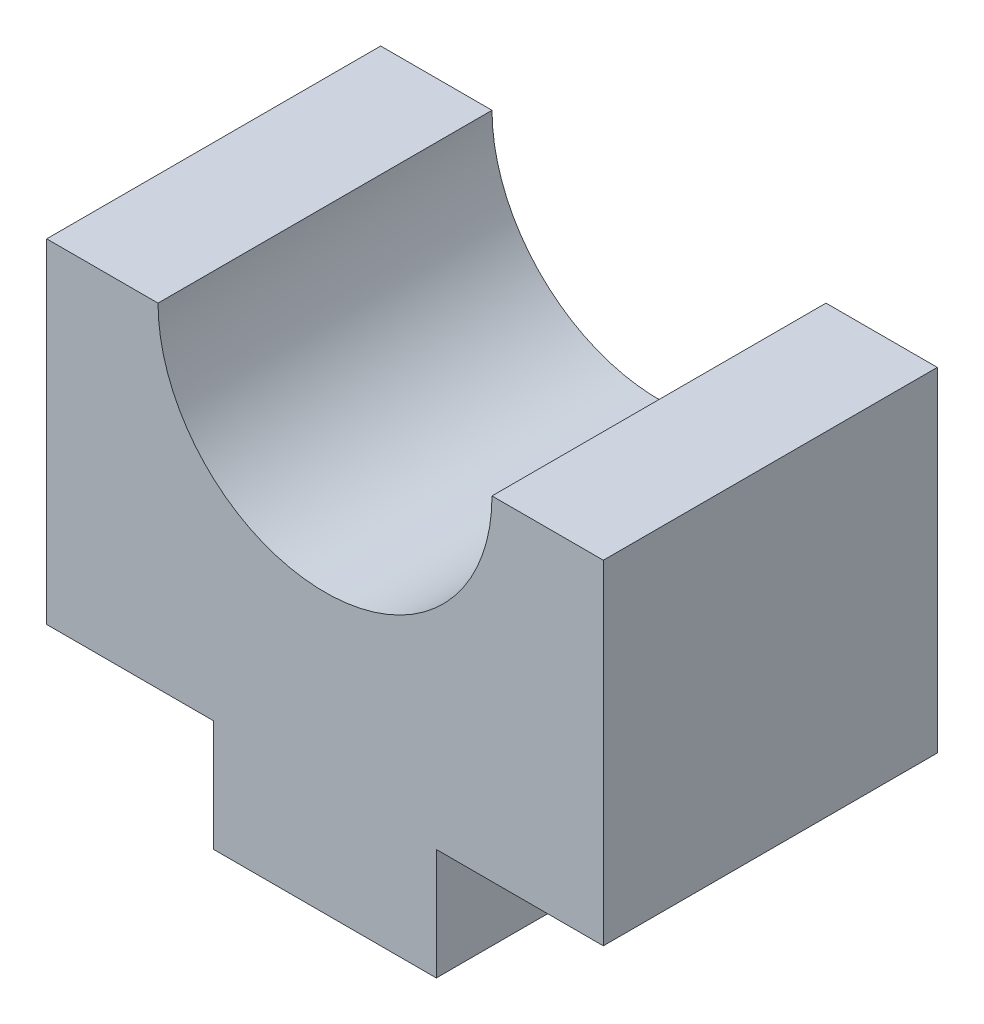
ISO-10303-21;
HEADER;
FILE_DESCRIPTION(('STEP AP214'),'2;1');
FILE_NAME('part.step','',(''),(''),'','','');
FILE_SCHEMA(('AUTOMOTIVE_DESIGN { 1 0 10303 214 1 1 1 1 }'));
ENDSEC;
DATA;
#1=APPLICATION_CONTEXT('core data for automotive mechanical design processes');
#2=APPLICATION_PROTOCOL_DEFINITION('international standard','automotive_design',2000,#1);
#3=PRODUCT_CONTEXT('',#1,'mechanical');
#4=PRODUCT('Part','Part','',(#3));
#5=PRODUCT_RELATED_PRODUCT_CATEGORY('part','',(#4));
#6=PRODUCT_DEFINITION_FORMATION('','',#4);
#7=PRODUCT_DEFINITION_CONTEXT('part definition',#1,'design');
#8=PRODUCT_DEFINITION('design','',#6,#7);
#9=PRODUCT_DEFINITION_SHAPE('','',#8);
#10=(LENGTH_UNIT() NAMED_UNIT(*) SI_UNIT(.MILLI.,.METRE.));
#11=(NAMED_UNIT(*) PLANE_ANGLE_UNIT() SI_UNIT($,.RADIAN.));
#12=(NAMED_UNIT(*) SI_UNIT($,.STERADIAN.) SOLID_ANGLE_UNIT());
#13=UNCERTAINTY_MEASURE_WITH_UNIT(LENGTH_MEASURE(1.E-05),#10,'distance_accuracy_value','');
#14=(GEOMETRIC_REPRESENTATION_CONTEXT(3) GLOBAL_UNCERTAINTY_ASSIGNED_CONTEXT((#13)) GLOBAL_UNIT_ASSIGNED_CONTEXT((#10,
#11,#12)) REPRESENTATION_CONTEXT('',''));
#15=CARTESIAN_POINT('',(0.,0.,0.));
#16=DIRECTION('',(0.,0.,1.));
#17=DIRECTION('',(1.,0.,0.));
#18=AXIS2_PLACEMENT_3D('',#15,#16,#17);
#19=CARTESIAN_POINT('',(0.,20.,0.));
#20=DIRECTION('',(0.,1.,0.));
#21=DIRECTION('',(0.,0.,1.));
#22=AXIS2_PLACEMENT_3D('',#19,#20,#21);
#23=PLANE('',#22);
#24=DIRECTION('',(0.,0.,1.));
#25=VECTOR('',#24,1.);
#26=CARTESIAN_POINT('',(5.00000000000294,20.,-5.));
#27=LINE('',#26,#25);
#28=CARTESIAN_POINT('',(5.00000000000294,20.,0.));
#29=VERTEX_POINT('',#28);
#30=CARTESIAN_POINT('',(5.00000000000294,20.,15.));
#31=VERTEX_POINT('',#30);
#32=EDGE_CURVE('E12',#29,#31,#27,.T.);
#33=ORIENTED_EDGE('',*,*,#32,.F.);
#34=DIRECTION('',(-1.,0.,0.));
#35=VECTOR('',#34,1.);
#36=CARTESIAN_POINT('',(0.,20.,0.));
#37=LINE('',#36,#35);
#38=CARTESIAN_POINT('',(0.,20.,0.));
#39=VERTEX_POINT('',#38);
#40=EDGE_CURVE('E139',#29,#39,#37,.T.);
#41=ORIENTED_EDGE('',*,*,#40,.T.);
#42=DIRECTION('',(0.,0.,1.));
#43=VECTOR('',#42,1.);
#44=CARTESIAN_POINT('',(0.,20.,0.));
#45=LINE('',#44,#43);
#46=CARTESIAN_POINT('',(0.,20.,15.));
#47=VERTEX_POINT('',#46);
#48=EDGE_CURVE('E132',#39,#47,#45,.T.);
#49=ORIENTED_EDGE('',*,*,#48,.T.);
#50=DIRECTION('',(1.,0.,0.));
#51=VECTOR('',#50,1.);
#52=CARTESIAN_POINT('',(0.,20.,15.));
#53=LINE('',#52,#51);
#54=EDGE_CURVE('E125',#47,#31,#53,.T.);
#55=ORIENTED_EDGE('',*,*,#54,.T.);
#56=EDGE_LOOP('',(#33,#41,#49,#55));
#57=FACE_BOUND('',#56,.T.);
#58=ADVANCED_FACE('F40',(#57),#23,.T.);
#59=CARTESIAN_POINT('',(0.,20.,0.));
#60=DIRECTION('',(1.,0.,0.));
#61=DIRECTION('',(0.,0.,-1.));
#62=AXIS2_PLACEMENT_3D('',#59,#60,#61);
#63=PLANE('',#62);
#64=DIRECTION('',(0.,-1.,0.));
#65=VECTOR('',#64,1.);
#66=CARTESIAN_POINT('',(0.,20.,0.));
#67=LINE('',#66,#65);
#68=CARTESIAN_POINT('',(0.,5.,0.));
#69=VERTEX_POINT('',#68);
#70=EDGE_CURVE('E148',#39,#69,#67,.T.);
#71=ORIENTED_EDGE('',*,*,#70,.T.);
#72=DIRECTION('',(0.,0.,1.));
#73=VECTOR('',#72,1.);
#74=CARTESIAN_POINT('',(0.,5.,-5.));
#75=LINE('',#74,#73);
#76=CARTESIAN_POINT('',(0.,5.,15.));
#77=VERTEX_POINT('',#76);
#78=EDGE_CURVE('E229',#69,#77,#75,.T.);
#79=ORIENTED_EDGE('',*,*,#78,.T.);
#80=DIRECTION('',(0.,-1.,0.));
#81=VECTOR('',#80,1.);
#82=CARTESIAN_POINT('',(0.,20.,15.));
#83=LINE('',#82,#81);
#84=EDGE_CURVE('E169',#47,#77,#83,.T.);
#85=ORIENTED_EDGE('',*,*,#84,.F.);
#86=ORIENTED_EDGE('',*,*,#48,.F.);
#87=EDGE_LOOP('',(#71,#79,#85,#86));
#88=FACE_BOUND('',#87,.T.);
#89=ADVANCED_FACE('F42',(#88),#63,.F.);
#90=CARTESIAN_POINT('',(0.,20.,15.));
#91=DIRECTION('',(0.,0.,-1.));
#92=DIRECTION('',(-1.,0.,0.));
#93=AXIS2_PLACEMENT_3D('',#90,#91,#92);
#94=PLANE('',#93);
#95=CARTESIAN_POINT('',(19.9999999999999,20.,15.));
#96=VERTEX_POINT('',#95);
#97=CARTESIAN_POINT('',(25.,20.,15.));
#98=VERTEX_POINT('',#97);
#99=EDGE_CURVE('E128',#96,#98,#53,.T.);
#100=ORIENTED_EDGE('',*,*,#99,.F.);
#101=CARTESIAN_POINT('',(12.5000000000014,19.9999999999999,15.));
#102=DIRECTION('',(0.,0.,1.));
#103=DIRECTION('',(1.,0.,0.));
#104=AXIS2_PLACEMENT_3D('',#101,#102,#103);
#105=CIRCLE('',#104,7.49999999999846);
#106=EDGE_CURVE('E55',#31,#96,#105,.T.);
#107=ORIENTED_EDGE('',*,*,#106,.F.);
#108=ORIENTED_EDGE('',*,*,#54,.F.);
#109=ORIENTED_EDGE('',*,*,#84,.T.);
#110=DIRECTION('',(-1.,0.,0.));
#111=VECTOR('',#110,1.);
#112=CARTESIAN_POINT('',(7.5,5.,15.));
#113=LINE('',#112,#111);
#114=CARTESIAN_POINT('',(7.5,5.,15.));
#115=VERTEX_POINT('',#114);
#116=EDGE_CURVE('E225',#115,#77,#113,.T.);
#117=ORIENTED_EDGE('',*,*,#116,.F.);
#118=DIRECTION('',(0.,1.,0.));
#119=VECTOR('',#118,1.);
#120=CARTESIAN_POINT('',(7.5,0.,15.));
#121=LINE('',#120,#119);
#122=CARTESIAN_POINT('',(7.5,0.,15.));
#123=VERTEX_POINT('',#122);
#124=EDGE_CURVE('E193',#123,#115,#121,.T.);
#125=ORIENTED_EDGE('',*,*,#124,.F.);
#126=DIRECTION('',(1.,0.,0.));
#127=VECTOR('',#126,1.);
#128=CARTESIAN_POINT('',(0.,0.,15.));
#129=LINE('',#128,#127);
#130=CARTESIAN_POINT('',(17.5,0.,15.));
#131=VERTEX_POINT('',#130);
#132=EDGE_CURVE('E149',#123,#131,#129,.T.);
#133=ORIENTED_EDGE('',*,*,#132,.T.);
#134=DIRECTION('',(0.,-1.,0.));
#135=VECTOR('',#134,1.);
#136=CARTESIAN_POINT('',(17.5,0.,15.));
#137=LINE('',#136,#135);
#138=CARTESIAN_POINT('',(17.5,5.,15.));
#139=VERTEX_POINT('',#138);
#140=EDGE_CURVE('E63',#139,#131,#137,.T.);
#141=ORIENTED_EDGE('',*,*,#140,.F.);
#142=DIRECTION('',(-1.,0.,0.));
#143=VECTOR('',#142,1.);
#144=CARTESIAN_POINT('',(17.5,5.,15.));
#145=LINE('',#144,#143);
#146=CARTESIAN_POINT('',(25.,5.,15.));
#147=VERTEX_POINT('',#146);
#148=EDGE_CURVE('E210',#147,#139,#145,.T.);
#149=ORIENTED_EDGE('',*,*,#148,.F.);
#150=DIRECTION('',(0.,-1.,0.));
#151=VECTOR('',#150,1.);
#152=CARTESIAN_POINT('',(25.,20.,15.));
#153=LINE('',#152,#151);
#154=EDGE_CURVE('E165',#98,#147,#153,.T.);
#155=ORIENTED_EDGE('',*,*,#154,.F.);
#156=EDGE_LOOP('',(#100,#107,#108,#109,#117,#125,#133,#141,#149,#155));
#157=FACE_BOUND('',#156,.T.);
#158=ADVANCED_FACE('F123',(#157),#94,.F.);
#159=CARTESIAN_POINT('',(25.,20.,0.));
#160=DIRECTION('',(-1.,0.,0.));
#161=DIRECTION('',(0.,0.,1.));
#162=AXIS2_PLACEMENT_3D('',#159,#160,#161);
#163=PLANE('',#162);
#164=ORIENTED_EDGE('',*,*,#154,.T.);
#165=DIRECTION('',(0.,0.,1.));
#166=VECTOR('',#165,1.);
#167=CARTESIAN_POINT('',(25.,5.,-5.));
#168=LINE('',#167,#166);
#169=CARTESIAN_POINT('',(25.,5.,0.));
#170=VERTEX_POINT('',#169);
#171=EDGE_CURVE('E201',#170,#147,#168,.T.);
#172=ORIENTED_EDGE('',*,*,#171,.F.);
#173=DIRECTION('',(0.,-1.,0.));
#174=VECTOR('',#173,1.);
#175=CARTESIAN_POINT('',(25.,20.,0.));
#176=LINE('',#175,#174);
#177=CARTESIAN_POINT('',(25.,20.,0.));
#178=VERTEX_POINT('',#177);
#179=EDGE_CURVE('E161',#178,#170,#176,.T.);
#180=ORIENTED_EDGE('',*,*,#179,.F.);
#181=DIRECTION('',(0.,0.,-1.));
#182=VECTOR('',#181,1.);
#183=CARTESIAN_POINT('',(25.,20.,0.));
#184=LINE('',#183,#182);
#185=EDGE_CURVE('E135',#98,#178,#184,.T.);
#186=ORIENTED_EDGE('',*,*,#185,.F.);
#187=EDGE_LOOP('',(#164,#172,#180,#186));
#188=FACE_BOUND('',#187,.T.);
#189=ADVANCED_FACE('F200',(#188),#163,.F.);
#190=CARTESIAN_POINT('',(0.,20.,0.));
#191=DIRECTION('',(0.,0.,1.));
#192=DIRECTION('',(1.,0.,0.));
#193=AXIS2_PLACEMENT_3D('',#190,#191,#192);
#194=PLANE('',#193);
#195=ORIENTED_EDGE('',*,*,#40,.F.);
#196=CARTESIAN_POINT('',(12.5000000000014,19.9999999999999,0.));
#197=DIRECTION('',(0.,0.,1.));
#198=DIRECTION('',(1.,0.,0.));
#199=AXIS2_PLACEMENT_3D('',#196,#197,#198);
#200=CIRCLE('',#199,7.49999999999846);
#201=CARTESIAN_POINT('',(19.9999999999999,20.,0.));
#202=VERTEX_POINT('',#201);
#203=EDGE_CURVE('E117',#29,#202,#200,.T.);
#204=ORIENTED_EDGE('',*,*,#203,.T.);
#205=EDGE_CURVE('E144',#178,#202,#37,.T.);
#206=ORIENTED_EDGE('',*,*,#205,.F.);
#207=ORIENTED_EDGE('',*,*,#179,.T.);
#208=DIRECTION('',(-1.,0.,0.));
#209=VECTOR('',#208,1.);
#210=CARTESIAN_POINT('',(0.,5.,0.));
#211=LINE('',#210,#209);
#212=CARTESIAN_POINT('',(17.5,5.,0.));
#213=VERTEX_POINT('',#212);
#214=EDGE_CURVE('E183',#170,#213,#211,.T.);
#215=ORIENTED_EDGE('',*,*,#214,.T.);
#216=DIRECTION('',(0.,-1.,0.));
#217=VECTOR('',#216,1.);
#218=CARTESIAN_POINT('',(17.5,20.,0.));
#219=LINE('',#218,#217);
#220=CARTESIAN_POINT('',(17.5,0.,0.));
#221=VERTEX_POINT('',#220);
#222=EDGE_CURVE('E154',#213,#221,#219,.T.);
#223=ORIENTED_EDGE('',*,*,#222,.T.);
#224=DIRECTION('',(-1.,0.,0.));
#225=VECTOR('',#224,1.);
#226=CARTESIAN_POINT('',(0.,0.,0.));
#227=LINE('',#226,#225);
#228=CARTESIAN_POINT('',(7.5,0.,0.));
#229=VERTEX_POINT('',#228);
#230=EDGE_CURVE('E153',#221,#229,#227,.T.);
#231=ORIENTED_EDGE('',*,*,#230,.T.);
#232=DIRECTION('',(0.,1.,0.));
#233=VECTOR('',#232,1.);
#234=CARTESIAN_POINT('',(7.5,20.,0.));
#235=LINE('',#234,#233);
#236=CARTESIAN_POINT('',(7.5,5.,0.));
#237=VERTEX_POINT('',#236);
#238=EDGE_CURVE('E212',#229,#237,#235,.T.);
#239=ORIENTED_EDGE('',*,*,#238,.T.);
#240=DIRECTION('',(-1.,0.,0.));
#241=VECTOR('',#240,1.);
#242=CARTESIAN_POINT('',(0.,5.,0.));
#243=LINE('',#242,#241);
#244=EDGE_CURVE('E179',#237,#69,#243,.T.);
#245=ORIENTED_EDGE('',*,*,#244,.T.);
#246=ORIENTED_EDGE('',*,*,#70,.F.);
#247=EDGE_LOOP('',(#195,#204,#206,#207,#215,#223,#231,#239,#245,#246));
#248=FACE_BOUND('',#247,.T.);
#249=ADVANCED_FACE('F190',(#248),#194,.F.);
#250=DIRECTION('',(0.,0.,1.));
#251=VECTOR('',#250,1.);
#252=CARTESIAN_POINT('',(19.9999999999999,20.,-5.));
#253=LINE('',#252,#251);
#254=EDGE_CURVE('E49',#96,#202,#253,.F.);
#255=ORIENTED_EDGE('',*,*,#254,.F.);
#256=ORIENTED_EDGE('',*,*,#99,.T.);
#257=ORIENTED_EDGE('',*,*,#185,.T.);
#258=ORIENTED_EDGE('',*,*,#205,.T.);
#259=EDGE_LOOP('',(#255,#256,#257,#258));
#260=FACE_BOUND('',#259,.T.);
#261=ADVANCED_FACE('F195',(#260),#23,.T.);
#262=CARTESIAN_POINT('',(0.,0.,0.));
#263=DIRECTION('',(0.,1.,0.));
#264=DIRECTION('',(0.,0.,1.));
#265=AXIS2_PLACEMENT_3D('',#262,#263,#264);
#266=PLANE('',#265);
#267=ORIENTED_EDGE('',*,*,#230,.F.);
#268=DIRECTION('',(0.,0.,1.));
#269=VECTOR('',#268,1.);
#270=CARTESIAN_POINT('',(17.5,0.,0.));
#271=LINE('',#270,#269);
#272=EDGE_CURVE('E176',#221,#131,#271,.T.);
#273=ORIENTED_EDGE('',*,*,#272,.T.);
#274=ORIENTED_EDGE('',*,*,#132,.F.);
#275=DIRECTION('',(0.,0.,-1.));
#276=VECTOR('',#275,1.);
#277=CARTESIAN_POINT('',(7.5,0.,0.));
#278=LINE('',#277,#276);
#279=EDGE_CURVE('E172',#123,#229,#278,.T.);
#280=ORIENTED_EDGE('',*,*,#279,.T.);
#281=EDGE_LOOP('',(#267,#273,#274,#280));
#282=FACE_BOUND('',#281,.T.);
#283=ADVANCED_FACE('F246',(#282),#266,.F.);
#284=CARTESIAN_POINT('',(7.5,5.,-5.));
#285=DIRECTION('',(0.,1.,0.));
#286=DIRECTION('',(0.,0.,1.));
#287=AXIS2_PLACEMENT_3D('',#284,#285,#286);
#288=PLANE('',#287);
#289=DIRECTION('',(0.,0.,1.));
#290=VECTOR('',#289,1.);
#291=CARTESIAN_POINT('',(7.5,5.,-5.));
#292=LINE('',#291,#290);
#293=EDGE_CURVE('E228',#237,#115,#292,.T.);
#294=ORIENTED_EDGE('',*,*,#293,.T.);
#295=ORIENTED_EDGE('',*,*,#116,.T.);
#296=ORIENTED_EDGE('',*,*,#78,.F.);
#297=ORIENTED_EDGE('',*,*,#244,.F.);
#298=EDGE_LOOP('',(#294,#295,#296,#297));
#299=FACE_BOUND('',#298,.T.);
#300=ADVANCED_FACE('F238',(#299),#288,.F.);
#301=CARTESIAN_POINT('',(7.5,0.,-5.));
#302=DIRECTION('',(1.,0.,0.));
#303=DIRECTION('',(0.,0.,-1.));
#304=AXIS2_PLACEMENT_3D('',#301,#302,#303);
#305=PLANE('',#304);
#306=ORIENTED_EDGE('',*,*,#279,.F.);
#307=ORIENTED_EDGE('',*,*,#124,.T.);
#308=ORIENTED_EDGE('',*,*,#293,.F.);
#309=ORIENTED_EDGE('',*,*,#238,.F.);
#310=EDGE_LOOP('',(#306,#307,#308,#309));
#311=FACE_BOUND('',#310,.T.);
#312=ADVANCED_FACE('F242',(#311),#305,.F.);
#313=CARTESIAN_POINT('',(17.5,5.,-5.));
#314=DIRECTION('',(0.,1.,0.));
#315=DIRECTION('',(0.,0.,1.));
#316=AXIS2_PLACEMENT_3D('',#313,#314,#315);
#317=PLANE('',#316);
#318=ORIENTED_EDGE('',*,*,#171,.T.);
#319=ORIENTED_EDGE('',*,*,#148,.T.);
#320=DIRECTION('',(0.,0.,1.));
#321=VECTOR('',#320,1.);
#322=CARTESIAN_POINT('',(17.5,5.,-5.));
#323=LINE('',#322,#321);
#324=EDGE_CURVE('E209',#213,#139,#323,.T.);
#325=ORIENTED_EDGE('',*,*,#324,.F.);
#326=ORIENTED_EDGE('',*,*,#214,.F.);
#327=EDGE_LOOP('',(#318,#319,#325,#326));
#328=FACE_BOUND('',#327,.T.);
#329=ADVANCED_FACE('F206',(#328),#317,.F.);
#330=CARTESIAN_POINT('',(17.5,0.,-5.));
#331=DIRECTION('',(-1.,0.,0.));
#332=DIRECTION('',(0.,0.,1.));
#333=AXIS2_PLACEMENT_3D('',#330,#331,#332);
#334=PLANE('',#333);
#335=ORIENTED_EDGE('',*,*,#324,.T.);
#336=ORIENTED_EDGE('',*,*,#140,.T.);
#337=ORIENTED_EDGE('',*,*,#272,.F.);
#338=ORIENTED_EDGE('',*,*,#222,.F.);
#339=EDGE_LOOP('',(#335,#336,#337,#338));
#340=FACE_BOUND('',#339,.T.);
#341=ADVANCED_FACE('F249',(#340),#334,.F.);
#342=CARTESIAN_POINT('',(12.5000000000014,19.9999999999999,-5.));
#343=DIRECTION('',(0.,0.,1.));
#344=DIRECTION('',(1.,0.,0.));
#345=AXIS2_PLACEMENT_3D('',#342,#343,#344);
#346=CYLINDRICAL_SURFACE('',#345,7.49999999999846);
#347=ORIENTED_EDGE('',*,*,#32,.T.);
#348=ORIENTED_EDGE('',*,*,#106,.T.);
#349=ORIENTED_EDGE('',*,*,#254,.T.);
#350=ORIENTED_EDGE('',*,*,#203,.F.);
#351=EDGE_LOOP('',(#347,#348,#349,#350));
#352=FACE_BOUND('',#351,.T.);
#353=ADVANCED_FACE('F115',(#352),#346,.F.);
#354=CLOSED_SHELL('',(#58,#89,#158,#189,#249,#261,#283,#300,#312,#329,#341,#353));
#355=MANIFOLD_SOLID_BREP('B2',#354);
#356=ADVANCED_BREP_SHAPE_REPRESENTATION('',(#18,#355),#14);
#357=SHAPE_DEFINITION_REPRESENTATION(#9,#356);
ENDSEC;
END-ISO-10303-21;
